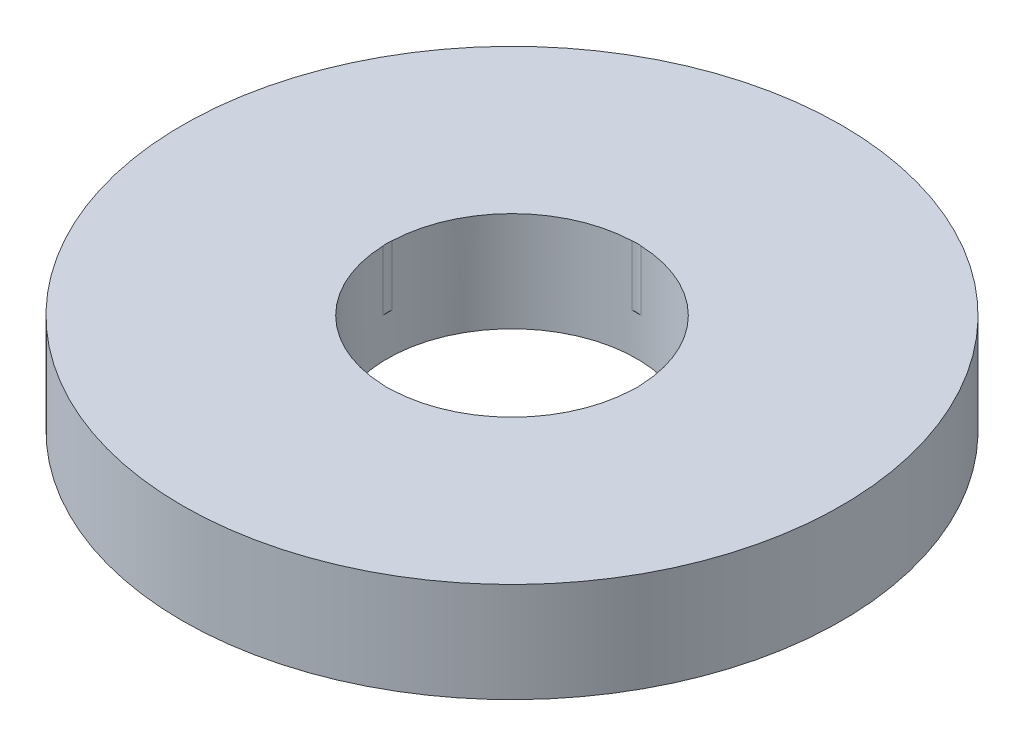
ISO-10303-21;
HEADER;
FILE_DESCRIPTION(('STEP AP214'),'2;1');
FILE_NAME('part.step','',(''),(''),'','','');
FILE_SCHEMA(('AUTOMOTIVE_DESIGN { 1 0 10303 214 1 1 1 1 }'));
ENDSEC;
DATA;
#1=APPLICATION_CONTEXT('core data for automotive mechanical design processes');
#2=APPLICATION_PROTOCOL_DEFINITION('international standard','automotive_design',2000,#1);
#3=PRODUCT_CONTEXT('',#1,'mechanical');
#4=PRODUCT('Part','Part','',(#3));
#5=PRODUCT_RELATED_PRODUCT_CATEGORY('part','',(#4));
#6=PRODUCT_DEFINITION_FORMATION('','',#4);
#7=PRODUCT_DEFINITION_CONTEXT('part definition',#1,'design');
#8=PRODUCT_DEFINITION('design','',#6,#7);
#9=PRODUCT_DEFINITION_SHAPE('','',#8);
#10=(LENGTH_UNIT() NAMED_UNIT(*) SI_UNIT(.MILLI.,.METRE.));
#11=(NAMED_UNIT(*) PLANE_ANGLE_UNIT() SI_UNIT($,.RADIAN.));
#12=(NAMED_UNIT(*) SI_UNIT($,.STERADIAN.) SOLID_ANGLE_UNIT());
#13=UNCERTAINTY_MEASURE_WITH_UNIT(LENGTH_MEASURE(1.E-05),#10,'distance_accuracy_value','');
#14=(GEOMETRIC_REPRESENTATION_CONTEXT(3) GLOBAL_UNCERTAINTY_ASSIGNED_CONTEXT((#13)) GLOBAL_UNIT_ASSIGNED_CONTEXT((#10,
#11,#12)) REPRESENTATION_CONTEXT('',''));
#15=CARTESIAN_POINT('',(0.,0.,0.));
#16=DIRECTION('',(0.,0.,1.));
#17=DIRECTION('',(1.,0.,0.));
#18=AXIS2_PLACEMENT_3D('',#15,#16,#17);
#19=CARTESIAN_POINT('',(0.,28.,0.));
#20=DIRECTION('',(0.,-1.,0.));
#21=DIRECTION('',(0.,0.,-1.));
#22=AXIS2_PLACEMENT_3D('',#19,#20,#21);
#23=CYLINDRICAL_SURFACE('',#22,92.5);
#24=CARTESIAN_POINT('',(0.,28.,0.));
#25=DIRECTION('',(0.,1.,0.));
#26=DIRECTION('',(0.,0.,1.));
#27=AXIS2_PLACEMENT_3D('',#24,#25,#26);
#28=CIRCLE('',#27,92.5);
#29=CARTESIAN_POINT('',(0.,28.,92.5));
#30=VERTEX_POINT('',#29);
#31=EDGE_CURVE('E148',#30,#30,#28,.T.);
#32=ORIENTED_EDGE('',*,*,#31,.F.);
#33=EDGE_LOOP('',(#32));
#34=FACE_BOUND('',#33,.T.);
#35=CARTESIAN_POINT('',(0.,0.,0.));
#36=DIRECTION('',(0.,1.,0.));
#37=DIRECTION('',(0.,0.,1.));
#38=AXIS2_PLACEMENT_3D('',#35,#36,#37);
#39=CIRCLE('',#38,92.5);
#40=CARTESIAN_POINT('',(0.,0.,92.5));
#41=VERTEX_POINT('',#40);
#42=EDGE_CURVE('E139',#41,#41,#39,.T.);
#43=ORIENTED_EDGE('',*,*,#42,.T.);
#44=EDGE_LOOP('',(#43));
#45=FACE_BOUND('',#44,.T.);
#46=ADVANCED_FACE('F39',(#34,#45),#23,.T.);
#47=CARTESIAN_POINT('',(0.,28.,0.));
#48=DIRECTION('',(0.,1.,0.));
#49=DIRECTION('',(0.,0.,1.));
#50=AXIS2_PLACEMENT_3D('',#47,#48,#49);
#51=PLANE('',#50);
#52=CARTESIAN_POINT('',(0.,28.,27.5734824603323));
#53=DIRECTION('',(0.,1.,0.));
#54=DIRECTION('',(1.,0.,0.));
#55=AXIS2_PLACEMENT_3D('',#52,#53,#54);
#56=CIRCLE('',#55,7.50817021644954);
#57=CARTESIAN_POINT('',(-1.24394990672429,28.,34.9778871378699));
#58=VERTEX_POINT('',#57);
#59=CARTESIAN_POINT('',(1.24394990672453,28.,34.9778871378698));
#60=VERTEX_POINT('',#59);
#61=EDGE_CURVE('E175',#58,#60,#56,.T.);
#62=ORIENTED_EDGE('',*,*,#61,.F.);
#63=CARTESIAN_POINT('',(0.,28.,0.));
#64=DIRECTION('',(0.,1.,0.));
#65=DIRECTION('',(0.,0.,1.));
#66=AXIS2_PLACEMENT_3D('',#63,#64,#65);
#67=CIRCLE('',#66,35.);
#68=CARTESIAN_POINT('',(-34.9778871378698,28.,1.24394990672441));
#69=VERTEX_POINT('',#68);
#70=EDGE_CURVE('E134',#69,#58,#67,.T.);
#71=ORIENTED_EDGE('',*,*,#70,.F.);
#72=CARTESIAN_POINT('',(-27.5734824603323,28.,0.));
#73=DIRECTION('',(0.,1.,0.));
#74=DIRECTION('',(0.,0.,1.));
#75=AXIS2_PLACEMENT_3D('',#72,#73,#74);
#76=CIRCLE('',#75,7.50817021644954);
#77=CARTESIAN_POINT('',(-34.9778871378698,28.,-1.24394990672441));
#78=VERTEX_POINT('',#77);
#79=EDGE_CURVE('E143',#78,#69,#76,.T.);
#80=ORIENTED_EDGE('',*,*,#79,.F.);
#81=CARTESIAN_POINT('',(-1.24394990672477,28.,-34.9778871378698));
#82=VERTEX_POINT('',#81);
#83=EDGE_CURVE('E123',#82,#78,#67,.T.);
#84=ORIENTED_EDGE('',*,*,#83,.F.);
#85=CARTESIAN_POINT('',(-2.88816898371506E-13,28.,-27.5734824603323));
#86=DIRECTION('',(0.,1.,0.));
#87=DIRECTION('',(-1.,0.,0.));
#88=AXIS2_PLACEMENT_3D('',#85,#86,#87);
#89=CIRCLE('',#88,7.50817021644954);
#90=CARTESIAN_POINT('',(1.24394990672404,28.,-34.9778871378699));
#91=VERTEX_POINT('',#90);
#92=EDGE_CURVE('E106',#91,#82,#89,.T.);
#93=ORIENTED_EDGE('',*,*,#92,.F.);
#94=CARTESIAN_POINT('',(34.9778871378698,28.,-1.24394990672441));
#95=VERTEX_POINT('',#94);
#96=EDGE_CURVE('E125',#95,#91,#67,.T.);
#97=ORIENTED_EDGE('',*,*,#96,.F.);
#98=CARTESIAN_POINT('',(27.5734824603323,28.,0.));
#99=DIRECTION('',(0.,1.,0.));
#100=DIRECTION('',(0.,0.,-1.));
#101=AXIS2_PLACEMENT_3D('',#98,#99,#100);
#102=CIRCLE('',#101,7.50817021644954);
#103=CARTESIAN_POINT('',(34.9778871378698,28.,1.24394990672441));
#104=VERTEX_POINT('',#103);
#105=EDGE_CURVE('E286',#104,#95,#102,.T.);
#106=ORIENTED_EDGE('',*,*,#105,.F.);
#107=EDGE_CURVE('E135',#60,#104,#67,.T.);
#108=ORIENTED_EDGE('',*,*,#107,.F.);
#109=EDGE_LOOP('',(#62,#71,#80,#84,#93,#97,#106,#108));
#110=FACE_BOUND('',#109,.T.);
#111=ORIENTED_EDGE('',*,*,#31,.T.);
#112=EDGE_LOOP('',(#111));
#113=FACE_BOUND('',#112,.T.);
#114=ADVANCED_FACE('F118',(#110,#113),#51,.T.);
#115=CARTESIAN_POINT('',(0.,0.,0.));
#116=DIRECTION('',(0.,1.,0.));
#117=DIRECTION('',(0.,0.,1.));
#118=AXIS2_PLACEMENT_3D('',#115,#116,#117);
#119=PLANE('',#118);
#120=CARTESIAN_POINT('',(0.,0.,0.));
#121=DIRECTION('',(0.,1.,0.));
#122=DIRECTION('',(0.,0.,1.));
#123=AXIS2_PLACEMENT_3D('',#120,#121,#122);
#124=CIRCLE('',#123,35.);
#125=CARTESIAN_POINT('',(0.,0.,35.));
#126=VERTEX_POINT('',#125);
#127=EDGE_CURVE('E136',#126,#126,#124,.T.);
#128=ORIENTED_EDGE('',*,*,#127,.T.);
#129=EDGE_LOOP('',(#128));
#130=FACE_BOUND('',#129,.T.);
#131=ORIENTED_EDGE('',*,*,#42,.F.);
#132=EDGE_LOOP('',(#131));
#133=FACE_BOUND('',#132,.T.);
#134=ADVANCED_FACE('F187',(#130,#133),#119,.F.);
#135=CARTESIAN_POINT('',(0.,28.,0.));
#136=DIRECTION('',(0.,-1.,0.));
#137=DIRECTION('',(0.,0.,-1.));
#138=AXIS2_PLACEMENT_3D('',#135,#136,#137);
#139=CYLINDRICAL_SURFACE('',#138,35.);
#140=DIRECTION('',(0.,1.,0.));
#141=VECTOR('',#140,1.);
#142=CARTESIAN_POINT('',(-1.24394990672436,19.572724108961,34.9778871378698));
#143=LINE('',#142,#141);
#144=CARTESIAN_POINT('',(-1.24394990672429,11.1454482179221,34.9778871378699));
#145=VERTEX_POINT('',#144);
#146=EDGE_CURVE('E11',#145,#58,#143,.T.);
#147=ORIENTED_EDGE('',*,*,#146,.F.);
#148=CARTESIAN_POINT('',(0.,11.1454482179221,0.));
#149=DIRECTION('',(0.,1.,0.));
#150=DIRECTION('',(0.,0.,1.));
#151=AXIS2_PLACEMENT_3D('',#148,#149,#150);
#152=CIRCLE('',#151,35.);
#153=CARTESIAN_POINT('',(1.24394990672453,11.1454482179221,34.9778871378698));
#154=VERTEX_POINT('',#153);
#155=EDGE_CURVE('E170',#145,#154,#152,.T.);
#156=ORIENTED_EDGE('',*,*,#155,.T.);
#157=DIRECTION('',(0.,1.,0.));
#158=VECTOR('',#157,1.);
#159=CARTESIAN_POINT('',(1.2439499067246,19.572724108961,34.9778871378698));
#160=LINE('',#159,#158);
#161=EDGE_CURVE('E46',#60,#154,#160,.F.);
#162=ORIENTED_EDGE('',*,*,#161,.F.);
#163=ORIENTED_EDGE('',*,*,#107,.T.);
#164=DIRECTION('',(0.,1.,0.));
#165=VECTOR('',#164,1.);
#166=CARTESIAN_POINT('',(34.9778871378698,19.572724108961,1.24394990672448));
#167=LINE('',#166,#165);
#168=CARTESIAN_POINT('',(34.9778871378698,11.1454482179221,1.24394990672441));
#169=VERTEX_POINT('',#168);
#170=EDGE_CURVE('E164',#169,#104,#167,.T.);
#171=ORIENTED_EDGE('',*,*,#170,.F.);
#172=CARTESIAN_POINT('',(0.,11.1454482179221,0.));
#173=DIRECTION('',(0.,1.,0.));
#174=DIRECTION('',(0.,0.,1.));
#175=AXIS2_PLACEMENT_3D('',#172,#173,#174);
#176=CIRCLE('',#175,35.);
#177=CARTESIAN_POINT('',(34.9778871378698,11.1454482179221,-1.24394990672441));
#178=VERTEX_POINT('',#177);
#179=EDGE_CURVE('E115',#169,#178,#176,.T.);
#180=ORIENTED_EDGE('',*,*,#179,.T.);
#181=DIRECTION('',(0.,1.,0.));
#182=VECTOR('',#181,1.);
#183=CARTESIAN_POINT('',(34.9778871378698,19.572724108961,-1.24394990672448));
#184=LINE('',#183,#182);
#185=EDGE_CURVE('E131',#95,#178,#184,.F.);
#186=ORIENTED_EDGE('',*,*,#185,.F.);
#187=ORIENTED_EDGE('',*,*,#96,.T.);
#188=DIRECTION('',(0.,1.,0.));
#189=VECTOR('',#188,1.);
#190=CARTESIAN_POINT('',(1.24394990672411,19.572724108961,-34.9778871378698));
#191=LINE('',#190,#189);
#192=CARTESIAN_POINT('',(1.24394990672404,11.1454482179221,-34.9778871378699));
#193=VERTEX_POINT('',#192);
#194=EDGE_CURVE('E105',#193,#91,#191,.T.);
#195=ORIENTED_EDGE('',*,*,#194,.F.);
#196=CARTESIAN_POINT('',(0.,11.1454482179221,0.));
#197=DIRECTION('',(0.,1.,0.));
#198=DIRECTION('',(0.,0.,1.));
#199=AXIS2_PLACEMENT_3D('',#196,#197,#198);
#200=CIRCLE('',#199,35.);
#201=CARTESIAN_POINT('',(-1.24394990672477,11.1454482179221,-34.9778871378698));
#202=VERTEX_POINT('',#201);
#203=EDGE_CURVE('E159',#193,#202,#200,.T.);
#204=ORIENTED_EDGE('',*,*,#203,.T.);
#205=DIRECTION('',(0.,1.,0.));
#206=VECTOR('',#205,1.);
#207=CARTESIAN_POINT('',(-1.24394990672485,19.572724108961,-34.9778871378698));
#208=LINE('',#207,#206);
#209=EDGE_CURVE('E114',#82,#202,#208,.F.);
#210=ORIENTED_EDGE('',*,*,#209,.F.);
#211=ORIENTED_EDGE('',*,*,#83,.T.);
#212=DIRECTION('',(0.,1.,0.));
#213=VECTOR('',#212,1.);
#214=CARTESIAN_POINT('',(-34.9778871378698,19.572724108961,-1.24394990672448));
#215=LINE('',#214,#213);
#216=CARTESIAN_POINT('',(-34.9778871378698,11.1454482179221,-1.24394990672441));
#217=VERTEX_POINT('',#216);
#218=EDGE_CURVE('E160',#217,#78,#215,.T.);
#219=ORIENTED_EDGE('',*,*,#218,.F.);
#220=CARTESIAN_POINT('',(0.,11.1454482179221,0.));
#221=DIRECTION('',(0.,1.,0.));
#222=DIRECTION('',(0.,0.,1.));
#223=AXIS2_PLACEMENT_3D('',#220,#221,#222);
#224=CIRCLE('',#223,35.);
#225=CARTESIAN_POINT('',(-34.9778871378698,11.1454482179221,1.24394990672441));
#226=VERTEX_POINT('',#225);
#227=EDGE_CURVE('E149',#217,#226,#224,.T.);
#228=ORIENTED_EDGE('',*,*,#227,.T.);
#229=DIRECTION('',(0.,1.,0.));
#230=VECTOR('',#229,1.);
#231=CARTESIAN_POINT('',(-34.9778871378698,19.572724108961,1.24394990672448));
#232=LINE('',#231,#230);
#233=EDGE_CURVE('E152',#69,#226,#232,.F.);
#234=ORIENTED_EDGE('',*,*,#233,.F.);
#235=ORIENTED_EDGE('',*,*,#70,.T.);
#236=EDGE_LOOP('',(#147,#156,#162,#163,#171,#180,#186,#187,#195,#204,#210,#211,#219,#228,#234,#235));
#237=FACE_BOUND('',#236,.T.);
#238=ORIENTED_EDGE('',*,*,#127,.F.);
#239=EDGE_LOOP('',(#238));
#240=FACE_BOUND('',#239,.T.);
#241=ADVANCED_FACE('F126',(#237,#240),#139,.F.);
#242=CARTESIAN_POINT('',(-27.5734824603323,11.1454482179221,0.));
#243=DIRECTION('',(0.,1.,0.));
#244=DIRECTION('',(0.,0.,1.));
#245=AXIS2_PLACEMENT_3D('',#242,#243,#244);
#246=CYLINDRICAL_SURFACE('',#245,7.50817021644954);
#247=ORIENTED_EDGE('',*,*,#218,.T.);
#248=ORIENTED_EDGE('',*,*,#79,.T.);
#249=ORIENTED_EDGE('',*,*,#233,.T.);
#250=CARTESIAN_POINT('',(-27.5734824603323,11.1454482179221,0.));
#251=DIRECTION('',(0.,1.,0.));
#252=DIRECTION('',(0.,0.,1.));
#253=AXIS2_PLACEMENT_3D('',#250,#251,#252);
#254=CIRCLE('',#253,7.50817021644954);
#255=EDGE_CURVE('E144',#217,#226,#254,.T.);
#256=ORIENTED_EDGE('',*,*,#255,.F.);
#257=EDGE_LOOP('',(#247,#248,#249,#256));
#258=FACE_BOUND('',#257,.T.);
#259=ADVANCED_FACE('F200',(#258),#246,.F.);
#260=CARTESIAN_POINT('',(-27.5734824603323,11.1454482179221,0.));
#261=DIRECTION('',(0.,1.,0.));
#262=DIRECTION('',(0.,0.,1.));
#263=AXIS2_PLACEMENT_3D('',#260,#261,#262);
#264=PLANE('',#263);
#265=ORIENTED_EDGE('',*,*,#255,.T.);
#266=ORIENTED_EDGE('',*,*,#227,.F.);
#267=EDGE_LOOP('',(#265,#266));
#268=FACE_BOUND('',#267,.T.);
#269=ADVANCED_FACE('F201',(#268),#264,.T.);
#270=CARTESIAN_POINT('',(-2.88816898371506E-13,11.1454482179221,-27.5734824603323));
#271=DIRECTION('',(0.,1.,0.));
#272=DIRECTION('',(0.,0.,1.));
#273=AXIS2_PLACEMENT_3D('',#270,#271,#272);
#274=CYLINDRICAL_SURFACE('',#273,7.50817021644954);
#275=ORIENTED_EDGE('',*,*,#194,.T.);
#276=ORIENTED_EDGE('',*,*,#92,.T.);
#277=ORIENTED_EDGE('',*,*,#209,.T.);
#278=CARTESIAN_POINT('',(-2.88816898371506E-13,11.1454482179221,-27.5734824603323));
#279=DIRECTION('',(0.,1.,0.));
#280=DIRECTION('',(-1.,0.,0.));
#281=AXIS2_PLACEMENT_3D('',#278,#279,#280);
#282=CIRCLE('',#281,7.50817021644954);
#283=EDGE_CURVE('E107',#193,#202,#282,.T.);
#284=ORIENTED_EDGE('',*,*,#283,.F.);
#285=EDGE_LOOP('',(#275,#276,#277,#284));
#286=FACE_BOUND('',#285,.T.);
#287=ADVANCED_FACE('F102',(#286),#274,.F.);
#288=CARTESIAN_POINT('',(-2.88816898371506E-13,11.1454482179221,-27.5734824603323));
#289=DIRECTION('',(0.,1.,0.));
#290=DIRECTION('',(-1.,0.,0.));
#291=AXIS2_PLACEMENT_3D('',#288,#289,#290);
#292=PLANE('',#291);
#293=ORIENTED_EDGE('',*,*,#283,.T.);
#294=ORIENTED_EDGE('',*,*,#203,.F.);
#295=EDGE_LOOP('',(#293,#294));
#296=FACE_BOUND('',#295,.T.);
#297=ADVANCED_FACE('F209',(#296),#292,.T.);
#298=CARTESIAN_POINT('',(27.5734824603323,11.1454482179221,0.));
#299=DIRECTION('',(0.,1.,0.));
#300=DIRECTION('',(0.,0.,1.));
#301=AXIS2_PLACEMENT_3D('',#298,#299,#300);
#302=CYLINDRICAL_SURFACE('',#301,7.50817021644954);
#303=ORIENTED_EDGE('',*,*,#170,.T.);
#304=ORIENTED_EDGE('',*,*,#105,.T.);
#305=ORIENTED_EDGE('',*,*,#185,.T.);
#306=CARTESIAN_POINT('',(27.5734824603323,11.1454482179221,0.));
#307=DIRECTION('',(0.,1.,0.));
#308=DIRECTION('',(0.,0.,-1.));
#309=AXIS2_PLACEMENT_3D('',#306,#307,#308);
#310=CIRCLE('',#309,7.50817021644954);
#311=EDGE_CURVE('E56',#169,#178,#310,.T.);
#312=ORIENTED_EDGE('',*,*,#311,.F.);
#313=EDGE_LOOP('',(#303,#304,#305,#312));
#314=FACE_BOUND('',#313,.T.);
#315=ADVANCED_FACE('F213',(#314),#302,.F.);
#316=CARTESIAN_POINT('',(27.5734824603323,11.1454482179221,0.));
#317=DIRECTION('',(0.,1.,0.));
#318=DIRECTION('',(0.,0.,-1.));
#319=AXIS2_PLACEMENT_3D('',#316,#317,#318);
#320=PLANE('',#319);
#321=ORIENTED_EDGE('',*,*,#311,.T.);
#322=ORIENTED_EDGE('',*,*,#179,.F.);
#323=EDGE_LOOP('',(#321,#322));
#324=FACE_BOUND('',#323,.T.);
#325=ADVANCED_FACE('F179',(#324),#320,.T.);
#326=CARTESIAN_POINT('',(0.,11.1454482179221,27.5734824603323));
#327=DIRECTION('',(0.,1.,0.));
#328=DIRECTION('',(0.,0.,1.));
#329=AXIS2_PLACEMENT_3D('',#326,#327,#328);
#330=CYLINDRICAL_SURFACE('',#329,7.50817021644954);
#331=ORIENTED_EDGE('',*,*,#146,.T.);
#332=ORIENTED_EDGE('',*,*,#61,.T.);
#333=ORIENTED_EDGE('',*,*,#161,.T.);
#334=CARTESIAN_POINT('',(0.,11.1454482179221,27.5734824603323));
#335=DIRECTION('',(0.,1.,0.));
#336=DIRECTION('',(1.,0.,0.));
#337=AXIS2_PLACEMENT_3D('',#334,#335,#336);
#338=CIRCLE('',#337,7.50817021644954);
#339=EDGE_CURVE('E55',#145,#154,#338,.T.);
#340=ORIENTED_EDGE('',*,*,#339,.F.);
#341=EDGE_LOOP('',(#331,#332,#333,#340));
#342=FACE_BOUND('',#341,.T.);
#343=ADVANCED_FACE('F171',(#342),#330,.F.);
#344=CARTESIAN_POINT('',(0.,11.1454482179221,27.5734824603323));
#345=DIRECTION('',(0.,1.,0.));
#346=DIRECTION('',(1.,0.,0.));
#347=AXIS2_PLACEMENT_3D('',#344,#345,#346);
#348=PLANE('',#347);
#349=ORIENTED_EDGE('',*,*,#339,.T.);
#350=ORIENTED_EDGE('',*,*,#155,.F.);
#351=EDGE_LOOP('',(#349,#350));
#352=FACE_BOUND('',#351,.T.);
#353=ADVANCED_FACE('F173',(#352),#348,.T.);
#354=CLOSED_SHELL('',(#46,#114,#134,#241,#259,#269,#287,#297,#315,#325,#343,#353));
#355=MANIFOLD_SOLID_BREP('B2',#354);
#356=ADVANCED_BREP_SHAPE_REPRESENTATION('',(#18,#355),#14);
#357=SHAPE_DEFINITION_REPRESENTATION(#9,#356);
ENDSEC;
END-ISO-10303-21;
